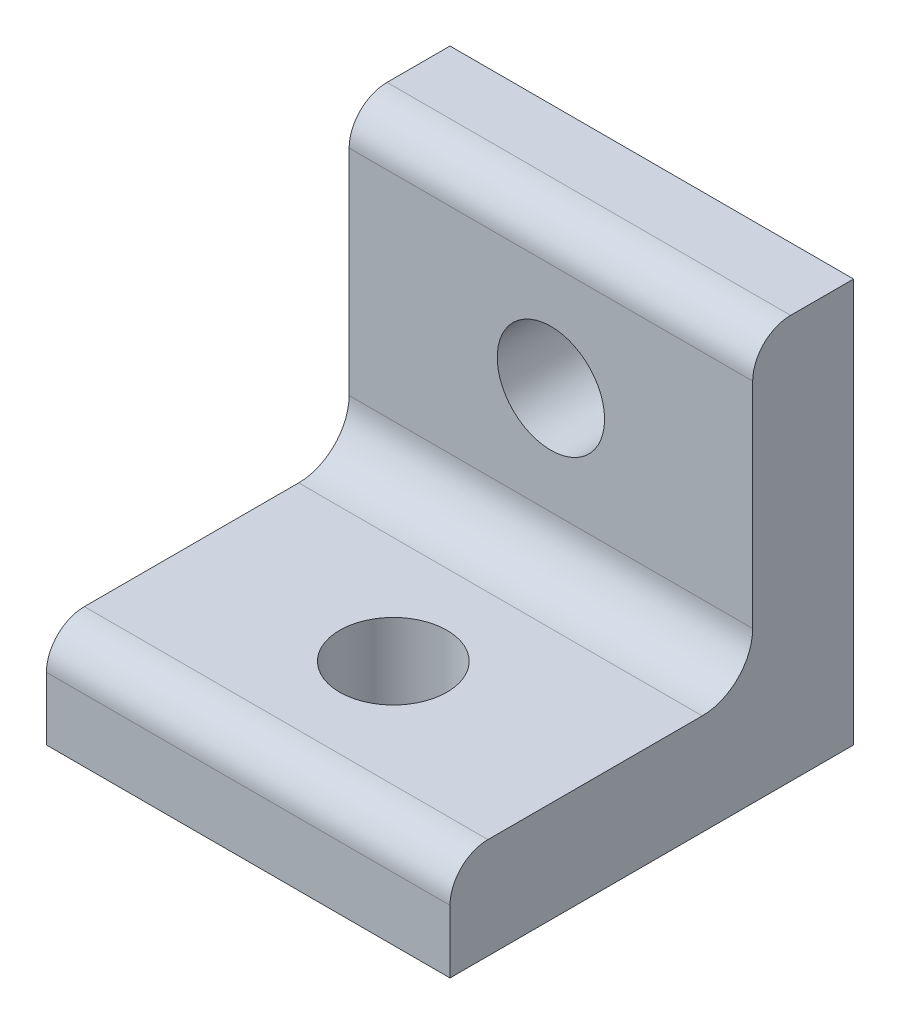
ISO-10303-21;
HEADER;
FILE_DESCRIPTION(('STEP AP214'),'2;1');
FILE_NAME('part.step','',(''),(''),'','','');
FILE_SCHEMA(('AUTOMOTIVE_DESIGN { 1 0 10303 214 1 1 1 1 }'));
ENDSEC;
DATA;
#1=APPLICATION_CONTEXT('core data for automotive mechanical design processes');
#2=APPLICATION_PROTOCOL_DEFINITION('international standard','automotive_design',2000,#1);
#3=PRODUCT_CONTEXT('',#1,'mechanical');
#4=PRODUCT('Part','Part','',(#3));
#5=PRODUCT_RELATED_PRODUCT_CATEGORY('part','',(#4));
#6=PRODUCT_DEFINITION_FORMATION('','',#4);
#7=PRODUCT_DEFINITION_CONTEXT('part definition',#1,'design');
#8=PRODUCT_DEFINITION('design','',#6,#7);
#9=PRODUCT_DEFINITION_SHAPE('','',#8);
#10=(LENGTH_UNIT() NAMED_UNIT(*) SI_UNIT(.MILLI.,.METRE.));
#11=(NAMED_UNIT(*) PLANE_ANGLE_UNIT() SI_UNIT($,.RADIAN.));
#12=(NAMED_UNIT(*) SI_UNIT($,.STERADIAN.) SOLID_ANGLE_UNIT());
#13=UNCERTAINTY_MEASURE_WITH_UNIT(LENGTH_MEASURE(1.E-05),#10,'distance_accuracy_value','');
#14=(GEOMETRIC_REPRESENTATION_CONTEXT(3) GLOBAL_UNCERTAINTY_ASSIGNED_CONTEXT((#13)) GLOBAL_UNIT_ASSIGNED_CONTEXT((#10,
#11,#12)) REPRESENTATION_CONTEXT('',''));
#15=CARTESIAN_POINT('',(0.,0.,0.));
#16=DIRECTION('',(0.,0.,1.));
#17=DIRECTION('',(1.,0.,0.));
#18=AXIS2_PLACEMENT_3D('',#15,#16,#17);
#19=CARTESIAN_POINT('',(0.,6.35,0.));
#20=DIRECTION('',(0.,-1.,0.));
#21=DIRECTION('',(0.,0.,-1.));
#22=AXIS2_PLACEMENT_3D('',#19,#20,#21);
#23=PLANE('',#22);
#24=CARTESIAN_POINT('',(12.7,6.35,-9.1313));
#25=DIRECTION('',(0.,1.,0.));
#26=DIRECTION('',(0.,0.,1.));
#27=AXIS2_PLACEMENT_3D('',#24,#25,#26);
#28=CIRCLE('',#27,3.3782);
#29=CARTESIAN_POINT('',(12.7,6.35,-5.7531));
#30=VERTEX_POINT('',#29);
#31=EDGE_CURVE('E133',#30,#30,#28,.T.);
#32=ORIENTED_EDGE('',*,*,#31,.F.);
#33=EDGE_LOOP('',(#32));
#34=FACE_BOUND('',#33,.T.);
#35=DIRECTION('',(0.,0.,1.));
#36=VECTOR('',#35,1.);
#37=CARTESIAN_POINT('',(0.,6.35,0.));
#38=LINE('',#37,#36);
#39=CARTESIAN_POINT('',(0.,6.35,-15.875));
#40=VERTEX_POINT('',#39);
#41=CARTESIAN_POINT('',(0.,6.35,-2.3876));
#42=VERTEX_POINT('',#41);
#43=EDGE_CURVE('E139',#40,#42,#38,.T.);
#44=ORIENTED_EDGE('',*,*,#43,.T.);
#45=DIRECTION('',(1.,0.,0.));
#46=VECTOR('',#45,1.);
#47=CARTESIAN_POINT('',(0.,6.35,-2.3876));
#48=LINE('',#47,#46);
#49=CARTESIAN_POINT('',(25.4,6.35,-2.3876));
#50=VERTEX_POINT('',#49);
#51=EDGE_CURVE('E165',#42,#50,#48,.T.);
#52=ORIENTED_EDGE('',*,*,#51,.T.);
#53=DIRECTION('',(0.,0.,-1.));
#54=VECTOR('',#53,1.);
#55=CARTESIAN_POINT('',(25.4,6.35,0.));
#56=LINE('',#55,#54);
#57=CARTESIAN_POINT('',(25.4,6.35,-15.875));
#58=VERTEX_POINT('',#57);
#59=EDGE_CURVE('E123',#50,#58,#56,.T.);
#60=ORIENTED_EDGE('',*,*,#59,.T.);
#61=DIRECTION('',(1.,0.,0.));
#62=VECTOR('',#61,1.);
#63=CARTESIAN_POINT('',(0.,6.35,-15.875));
#64=LINE('',#63,#62);
#65=EDGE_CURVE('E158',#58,#40,#64,.F.);
#66=ORIENTED_EDGE('',*,*,#65,.T.);
#67=EDGE_LOOP('',(#44,#52,#60,#66));
#68=FACE_BOUND('',#67,.T.);
#69=ADVANCED_FACE('F32',(#34,#68),#23,.F.);
#70=CARTESIAN_POINT('',(0.,6.35,0.));
#71=DIRECTION('',(1.,0.,0.));
#72=DIRECTION('',(0.,0.,-1.));
#73=AXIS2_PLACEMENT_3D('',#70,#71,#72);
#74=PLANE('',#73);
#75=DIRECTION('',(0.,-1.,0.));
#76=VECTOR('',#75,1.);
#77=CARTESIAN_POINT('',(0.,6.35,0.));
#78=LINE('',#77,#76);
#79=CARTESIAN_POINT('',(0.,3.9624,0.));
#80=VERTEX_POINT('',#79);
#81=CARTESIAN_POINT('',(0.,0.,0.));
#82=VERTEX_POINT('',#81);
#83=EDGE_CURVE('E153',#80,#82,#78,.T.);
#84=ORIENTED_EDGE('',*,*,#83,.F.);
#85=CARTESIAN_POINT('',(0.,3.9624,-2.3876));
#86=DIRECTION('',(1.,0.,0.));
#87=DIRECTION('',(0.,0.,-1.));
#88=AXIS2_PLACEMENT_3D('',#85,#86,#87);
#89=CIRCLE('',#88,2.3876);
#90=EDGE_CURVE('E175',#80,#42,#89,.F.);
#91=ORIENTED_EDGE('',*,*,#90,.T.);
#92=ORIENTED_EDGE('',*,*,#43,.F.);
#93=CARTESIAN_POINT('',(0.,9.525,-15.875));
#94=DIRECTION('',(1.,0.,0.));
#95=DIRECTION('',(0.,0.,-1.));
#96=AXIS2_PLACEMENT_3D('',#93,#94,#95);
#97=CIRCLE('',#96,3.175);
#98=CARTESIAN_POINT('',(0.,9.525,-19.05));
#99=VERTEX_POINT('',#98);
#100=EDGE_CURVE('E163',#40,#99,#97,.T.);
#101=ORIENTED_EDGE('',*,*,#100,.T.);
#102=DIRECTION('',(0.,1.,0.));
#103=VECTOR('',#102,1.);
#104=CARTESIAN_POINT('',(0.,0.,-19.05));
#105=LINE('',#104,#103);
#106=CARTESIAN_POINT('',(0.,23.0124,-19.05));
#107=VERTEX_POINT('',#106);
#108=EDGE_CURVE('E128',#99,#107,#105,.T.);
#109=ORIENTED_EDGE('',*,*,#108,.T.);
#110=CARTESIAN_POINT('',(0.,23.0124,-21.4376));
#111=DIRECTION('',(1.,0.,0.));
#112=DIRECTION('',(0.,0.,-1.));
#113=AXIS2_PLACEMENT_3D('',#110,#111,#112);
#114=CIRCLE('',#113,2.3876);
#115=CARTESIAN_POINT('',(0.,25.4,-21.4376));
#116=VERTEX_POINT('',#115);
#117=EDGE_CURVE('E47',#107,#116,#114,.F.);
#118=ORIENTED_EDGE('',*,*,#117,.T.);
#119=DIRECTION('',(0.,0.,-1.));
#120=VECTOR('',#119,1.);
#121=CARTESIAN_POINT('',(0.,25.4,-19.05));
#122=LINE('',#121,#120);
#123=CARTESIAN_POINT('',(0.,25.4,-25.4));
#124=VERTEX_POINT('',#123);
#125=EDGE_CURVE('E101',#116,#124,#122,.T.);
#126=ORIENTED_EDGE('',*,*,#125,.T.);
#127=DIRECTION('',(0.,-1.,0.));
#128=VECTOR('',#127,1.);
#129=CARTESIAN_POINT('',(0.,6.35,-25.4));
#130=LINE('',#129,#128);
#131=CARTESIAN_POINT('',(0.,0.,-25.4));
#132=VERTEX_POINT('',#131);
#133=EDGE_CURVE('E106',#124,#132,#130,.T.);
#134=ORIENTED_EDGE('',*,*,#133,.T.);
#135=DIRECTION('',(0.,0.,1.));
#136=VECTOR('',#135,1.);
#137=CARTESIAN_POINT('',(0.,0.,0.));
#138=LINE('',#137,#136);
#139=EDGE_CURVE('E137',#132,#82,#138,.T.);
#140=ORIENTED_EDGE('',*,*,#139,.T.);
#141=EDGE_LOOP('',(#84,#91,#92,#101,#109,#118,#126,#134,#140));
#142=FACE_BOUND('',#141,.T.);
#143=ADVANCED_FACE('F104',(#142),#74,.F.);
#144=CARTESIAN_POINT('',(0.,6.35,0.));
#145=DIRECTION('',(0.,0.,-1.));
#146=DIRECTION('',(-1.,0.,0.));
#147=AXIS2_PLACEMENT_3D('',#144,#145,#146);
#148=PLANE('',#147);
#149=DIRECTION('',(0.,-1.,0.));
#150=VECTOR('',#149,1.);
#151=CARTESIAN_POINT('',(25.4,6.35,0.));
#152=LINE('',#151,#150);
#153=CARTESIAN_POINT('',(25.4,3.9624,0.));
#154=VERTEX_POINT('',#153);
#155=CARTESIAN_POINT('',(25.4,0.,0.));
#156=VERTEX_POINT('',#155);
#157=EDGE_CURVE('E151',#154,#156,#152,.T.);
#158=ORIENTED_EDGE('',*,*,#157,.F.);
#159=DIRECTION('',(1.,0.,0.));
#160=VECTOR('',#159,1.);
#161=CARTESIAN_POINT('',(0.,3.9624,0.));
#162=LINE('',#161,#160);
#163=EDGE_CURVE('E172',#154,#80,#162,.F.);
#164=ORIENTED_EDGE('',*,*,#163,.T.);
#165=ORIENTED_EDGE('',*,*,#83,.T.);
#166=DIRECTION('',(1.,0.,0.));
#167=VECTOR('',#166,1.);
#168=CARTESIAN_POINT('',(0.,0.,0.));
#169=LINE('',#168,#167);
#170=EDGE_CURVE('E144',#82,#156,#169,.T.);
#171=ORIENTED_EDGE('',*,*,#170,.T.);
#172=EDGE_LOOP('',(#158,#164,#165,#171));
#173=FACE_BOUND('',#172,.T.);
#174=ADVANCED_FACE('F215',(#173),#148,.F.);
#175=CARTESIAN_POINT('',(25.4,6.35,0.));
#176=DIRECTION('',(-1.,0.,0.));
#177=DIRECTION('',(0.,0.,1.));
#178=AXIS2_PLACEMENT_3D('',#175,#176,#177);
#179=PLANE('',#178);
#180=ORIENTED_EDGE('',*,*,#59,.F.);
#181=CARTESIAN_POINT('',(25.4,3.9624,-2.3876));
#182=DIRECTION('',(-1.,0.,0.));
#183=DIRECTION('',(0.,0.,1.));
#184=AXIS2_PLACEMENT_3D('',#181,#182,#183);
#185=CIRCLE('',#184,2.3876);
#186=EDGE_CURVE('E170',#50,#154,#185,.F.);
#187=ORIENTED_EDGE('',*,*,#186,.T.);
#188=ORIENTED_EDGE('',*,*,#157,.T.);
#189=DIRECTION('',(0.,0.,-1.));
#190=VECTOR('',#189,1.);
#191=CARTESIAN_POINT('',(25.4,0.,0.));
#192=LINE('',#191,#190);
#193=CARTESIAN_POINT('',(25.4,0.,-25.4));
#194=VERTEX_POINT('',#193);
#195=EDGE_CURVE('E147',#156,#194,#192,.T.);
#196=ORIENTED_EDGE('',*,*,#195,.T.);
#197=DIRECTION('',(0.,-1.,0.));
#198=VECTOR('',#197,1.);
#199=CARTESIAN_POINT('',(25.4,6.35,-25.4));
#200=LINE('',#199,#198);
#201=CARTESIAN_POINT('',(25.4,25.4,-25.4));
#202=VERTEX_POINT('',#201);
#203=EDGE_CURVE('E122',#202,#194,#200,.T.);
#204=ORIENTED_EDGE('',*,*,#203,.F.);
#205=DIRECTION('',(0.,0.,-1.));
#206=VECTOR('',#205,1.);
#207=CARTESIAN_POINT('',(25.4,25.4,-19.05));
#208=LINE('',#207,#206);
#209=CARTESIAN_POINT('',(25.4,25.4,-21.4376));
#210=VERTEX_POINT('',#209);
#211=EDGE_CURVE('E112',#210,#202,#208,.T.);
#212=ORIENTED_EDGE('',*,*,#211,.F.);
#213=CARTESIAN_POINT('',(25.4,23.0124,-21.4376));
#214=DIRECTION('',(-1.,0.,0.));
#215=DIRECTION('',(0.,0.,1.));
#216=AXIS2_PLACEMENT_3D('',#213,#214,#215);
#217=CIRCLE('',#216,2.3876);
#218=CARTESIAN_POINT('',(25.4,23.0124,-19.05));
#219=VERTEX_POINT('',#218);
#220=EDGE_CURVE('E168',#210,#219,#217,.F.);
#221=ORIENTED_EDGE('',*,*,#220,.T.);
#222=DIRECTION('',(0.,-1.,0.));
#223=VECTOR('',#222,1.);
#224=CARTESIAN_POINT('',(25.4,0.,-19.05));
#225=LINE('',#224,#223);
#226=CARTESIAN_POINT('',(25.4,9.525,-19.05));
#227=VERTEX_POINT('',#226);
#228=EDGE_CURVE('E113',#219,#227,#225,.T.);
#229=ORIENTED_EDGE('',*,*,#228,.T.);
#230=CARTESIAN_POINT('',(25.4,9.525,-15.875));
#231=DIRECTION('',(-1.,0.,0.));
#232=DIRECTION('',(0.,0.,1.));
#233=AXIS2_PLACEMENT_3D('',#230,#231,#232);
#234=CIRCLE('',#233,3.175);
#235=EDGE_CURVE('E160',#227,#58,#234,.T.);
#236=ORIENTED_EDGE('',*,*,#235,.T.);
#237=EDGE_LOOP('',(#180,#187,#188,#196,#204,#212,#221,#229,#236));
#238=FACE_BOUND('',#237,.T.);
#239=ADVANCED_FACE('F179',(#238),#179,.F.);
#240=CARTESIAN_POINT('',(0.,6.35,-25.4));
#241=DIRECTION('',(0.,0.,1.));
#242=DIRECTION('',(1.,0.,0.));
#243=AXIS2_PLACEMENT_3D('',#240,#241,#242);
#244=PLANE('',#243);
#245=CARTESIAN_POINT('',(12.7,16.2687,-25.4));
#246=DIRECTION('',(0.,0.,1.));
#247=DIRECTION('',(1.,0.,0.));
#248=AXIS2_PLACEMENT_3D('',#245,#246,#247);
#249=CIRCLE('',#248,3.37819999999999);
#250=CARTESIAN_POINT('',(16.0782,16.2687,-25.4));
#251=VERTEX_POINT('',#250);
#252=EDGE_CURVE('E250',#251,#251,#249,.T.);
#253=ORIENTED_EDGE('',*,*,#252,.T.);
#254=EDGE_LOOP('',(#253));
#255=FACE_BOUND('',#254,.T.);
#256=DIRECTION('',(-1.,0.,0.));
#257=VECTOR('',#256,1.);
#258=CARTESIAN_POINT('',(0.,0.,-25.4));
#259=LINE('',#258,#257);
#260=EDGE_CURVE('E121',#194,#132,#259,.T.);
#261=ORIENTED_EDGE('',*,*,#260,.T.);
#262=ORIENTED_EDGE('',*,*,#133,.F.);
#263=DIRECTION('',(1.,0.,0.));
#264=VECTOR('',#263,1.);
#265=CARTESIAN_POINT('',(0.,25.4,-25.4));
#266=LINE('',#265,#264);
#267=EDGE_CURVE('E119',#124,#202,#266,.T.);
#268=ORIENTED_EDGE('',*,*,#267,.T.);
#269=ORIENTED_EDGE('',*,*,#203,.T.);
#270=EDGE_LOOP('',(#261,#262,#268,#269));
#271=FACE_BOUND('',#270,.T.);
#272=ADVANCED_FACE('F117',(#255,#271),#244,.F.);
#273=CARTESIAN_POINT('',(0.,0.,0.));
#274=DIRECTION('',(0.,-1.,0.));
#275=DIRECTION('',(0.,0.,-1.));
#276=AXIS2_PLACEMENT_3D('',#273,#274,#275);
#277=PLANE('',#276);
#278=CARTESIAN_POINT('',(12.7,0.,-9.1313));
#279=DIRECTION('',(0.,1.,0.));
#280=DIRECTION('',(0.,0.,1.));
#281=AXIS2_PLACEMENT_3D('',#278,#279,#280);
#282=CIRCLE('',#281,3.3782);
#283=CARTESIAN_POINT('',(12.7,0.,-5.7531));
#284=VERTEX_POINT('',#283);
#285=EDGE_CURVE('E129',#284,#284,#282,.T.);
#286=ORIENTED_EDGE('',*,*,#285,.T.);
#287=EDGE_LOOP('',(#286));
#288=FACE_BOUND('',#287,.T.);
#289=ORIENTED_EDGE('',*,*,#260,.F.);
#290=ORIENTED_EDGE('',*,*,#195,.F.);
#291=ORIENTED_EDGE('',*,*,#170,.F.);
#292=ORIENTED_EDGE('',*,*,#139,.F.);
#293=EDGE_LOOP('',(#289,#290,#291,#292));
#294=FACE_BOUND('',#293,.T.);
#295=ADVANCED_FACE('F182',(#288,#294),#277,.T.);
#296=CARTESIAN_POINT('',(0.,0.,-19.05));
#297=DIRECTION('',(0.,0.,-1.));
#298=DIRECTION('',(-1.,0.,0.));
#299=AXIS2_PLACEMENT_3D('',#296,#297,#298);
#300=PLANE('',#299);
#301=CARTESIAN_POINT('',(12.7,16.2687,-19.05));
#302=DIRECTION('',(0.,0.,1.));
#303=DIRECTION('',(1.,0.,0.));
#304=AXIS2_PLACEMENT_3D('',#301,#302,#303);
#305=CIRCLE('',#304,3.37819999999999);
#306=CARTESIAN_POINT('',(16.0782,16.2687,-19.05));
#307=VERTEX_POINT('',#306);
#308=EDGE_CURVE('E252',#307,#307,#305,.T.);
#309=ORIENTED_EDGE('',*,*,#308,.F.);
#310=EDGE_LOOP('',(#309));
#311=FACE_BOUND('',#310,.T.);
#312=ORIENTED_EDGE('',*,*,#228,.F.);
#313=DIRECTION('',(1.,0.,0.));
#314=VECTOR('',#313,1.);
#315=CARTESIAN_POINT('',(0.,23.0124,-19.05));
#316=LINE('',#315,#314);
#317=EDGE_CURVE('E11',#219,#107,#316,.F.);
#318=ORIENTED_EDGE('',*,*,#317,.T.);
#319=ORIENTED_EDGE('',*,*,#108,.F.);
#320=DIRECTION('',(1.,0.,0.));
#321=VECTOR('',#320,1.);
#322=CARTESIAN_POINT('',(25.4,9.525,-19.05));
#323=LINE('',#322,#321);
#324=EDGE_CURVE('E155',#99,#227,#323,.T.);
#325=ORIENTED_EDGE('',*,*,#324,.T.);
#326=EDGE_LOOP('',(#312,#318,#319,#325));
#327=FACE_BOUND('',#326,.T.);
#328=ADVANCED_FACE('F199',(#311,#327),#300,.F.);
#329=CARTESIAN_POINT('',(0.,25.4,-19.05));
#330=DIRECTION('',(0.,1.,0.));
#331=DIRECTION('',(-1.,0.,0.));
#332=AXIS2_PLACEMENT_3D('',#329,#330,#331);
#333=PLANE('',#332);
#334=ORIENTED_EDGE('',*,*,#125,.F.);
#335=DIRECTION('',(1.,0.,0.));
#336=VECTOR('',#335,1.);
#337=CARTESIAN_POINT('',(25.4,25.4,-21.4376));
#338=LINE('',#337,#336);
#339=EDGE_CURVE('E40',#116,#210,#338,.T.);
#340=ORIENTED_EDGE('',*,*,#339,.T.);
#341=ORIENTED_EDGE('',*,*,#211,.T.);
#342=ORIENTED_EDGE('',*,*,#267,.F.);
#343=EDGE_LOOP('',(#334,#340,#341,#342));
#344=FACE_BOUND('',#343,.T.);
#345=ADVANCED_FACE('F125',(#344),#333,.T.);
#346=CARTESIAN_POINT('',(0.,9.525,-15.875));
#347=DIRECTION('',(-1.,0.,0.));
#348=DIRECTION('',(0.,0.,1.));
#349=AXIS2_PLACEMENT_3D('',#346,#347,#348);
#350=CYLINDRICAL_SURFACE('',#349,3.175);
#351=ORIENTED_EDGE('',*,*,#100,.F.);
#352=ORIENTED_EDGE('',*,*,#65,.F.);
#353=ORIENTED_EDGE('',*,*,#235,.F.);
#354=ORIENTED_EDGE('',*,*,#324,.F.);
#355=EDGE_LOOP('',(#351,#352,#353,#354));
#356=FACE_BOUND('',#355,.T.);
#357=ADVANCED_FACE('F198',(#356),#350,.F.);
#358=CARTESIAN_POINT('',(0.,3.9624,-2.3876));
#359=DIRECTION('',(1.,0.,0.));
#360=DIRECTION('',(0.,0.,-1.));
#361=AXIS2_PLACEMENT_3D('',#358,#359,#360);
#362=CYLINDRICAL_SURFACE('',#361,2.3876);
#363=ORIENTED_EDGE('',*,*,#90,.F.);
#364=ORIENTED_EDGE('',*,*,#163,.F.);
#365=ORIENTED_EDGE('',*,*,#186,.F.);
#366=ORIENTED_EDGE('',*,*,#51,.F.);
#367=EDGE_LOOP('',(#363,#364,#365,#366));
#368=FACE_BOUND('',#367,.T.);
#369=ADVANCED_FACE('F190',(#368),#362,.T.);
#370=CARTESIAN_POINT('',(0.,23.0124,-21.4376));
#371=DIRECTION('',(-1.,0.,0.));
#372=DIRECTION('',(0.,-1.,0.));
#373=AXIS2_PLACEMENT_3D('',#370,#371,#372);
#374=CYLINDRICAL_SURFACE('',#373,2.3876);
#375=ORIENTED_EDGE('',*,*,#117,.F.);
#376=ORIENTED_EDGE('',*,*,#317,.F.);
#377=ORIENTED_EDGE('',*,*,#220,.F.);
#378=ORIENTED_EDGE('',*,*,#339,.F.);
#379=EDGE_LOOP('',(#375,#376,#377,#378));
#380=FACE_BOUND('',#379,.T.);
#381=ADVANCED_FACE('F34',(#380),#374,.T.);
#382=CARTESIAN_POINT('',(12.7,0.,-9.1313));
#383=DIRECTION('',(0.,1.,0.));
#384=DIRECTION('',(0.,0.,1.));
#385=AXIS2_PLACEMENT_3D('',#382,#383,#384);
#386=CYLINDRICAL_SURFACE('',#385,3.3782);
#387=ORIENTED_EDGE('',*,*,#285,.F.);
#388=EDGE_LOOP('',(#387));
#389=FACE_BOUND('',#388,.T.);
#390=ORIENTED_EDGE('',*,*,#31,.T.);
#391=EDGE_LOOP('',(#390));
#392=FACE_BOUND('',#391,.T.);
#393=ADVANCED_FACE('F201',(#389,#392),#386,.F.);
#394=CARTESIAN_POINT('',(12.7,16.2687,-25.4));
#395=DIRECTION('',(0.,0.,1.));
#396=DIRECTION('',(1.,0.,0.));
#397=AXIS2_PLACEMENT_3D('',#394,#395,#396);
#398=CYLINDRICAL_SURFACE('',#397,3.37819999999999);
#399=ORIENTED_EDGE('',*,*,#252,.F.);
#400=EDGE_LOOP('',(#399));
#401=FACE_BOUND('',#400,.T.);
#402=ORIENTED_EDGE('',*,*,#308,.T.);
#403=EDGE_LOOP('',(#402));
#404=FACE_BOUND('',#403,.T.);
#405=ADVANCED_FACE('F206',(#401,#404),#398,.F.);
#406=CLOSED_SHELL('',(#69,#143,#174,#239,#272,#295,#328,#345,#357,#369,#381,#393,#405));
#407=MANIFOLD_SOLID_BREP('B2',#406);
#408=ADVANCED_BREP_SHAPE_REPRESENTATION('',(#18,#407),#14);
#409=SHAPE_DEFINITION_REPRESENTATION(#9,#408);
ENDSEC;
END-ISO-10303-21;
